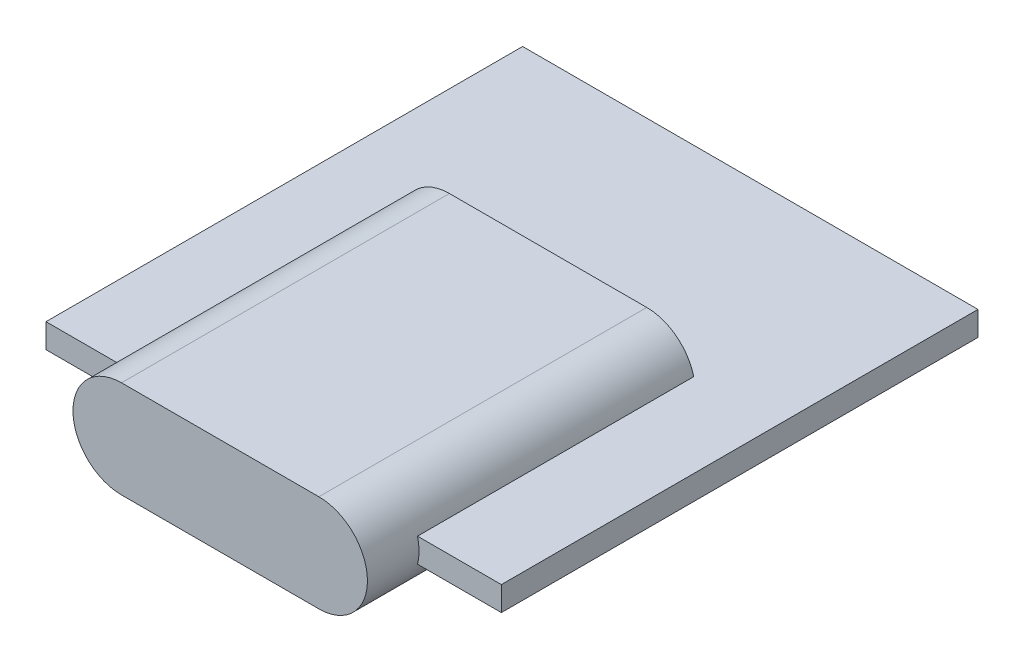
ISO-10303-21;
HEADER;
FILE_DESCRIPTION(('STEP AP214'),'2;1');
FILE_NAME('part.step','',(''),(''),'','','');
FILE_SCHEMA(('AUTOMOTIVE_DESIGN { 1 0 10303 214 1 1 1 1 }'));
ENDSEC;
DATA;
#1=APPLICATION_CONTEXT('core data for automotive mechanical design processes');
#2=APPLICATION_PROTOCOL_DEFINITION('international standard','automotive_design',2000,#1);
#3=PRODUCT_CONTEXT('',#1,'mechanical');
#4=PRODUCT('Part','Part','',(#3));
#5=PRODUCT_RELATED_PRODUCT_CATEGORY('part','',(#4));
#6=PRODUCT_DEFINITION_FORMATION('','',#4);
#7=PRODUCT_DEFINITION_CONTEXT('part definition',#1,'design');
#8=PRODUCT_DEFINITION('design','',#6,#7);
#9=PRODUCT_DEFINITION_SHAPE('','',#8);
#10=(LENGTH_UNIT() NAMED_UNIT(*) SI_UNIT(.MILLI.,.METRE.));
#11=(NAMED_UNIT(*) PLANE_ANGLE_UNIT() SI_UNIT($,.RADIAN.));
#12=(NAMED_UNIT(*) SI_UNIT($,.STERADIAN.) SOLID_ANGLE_UNIT());
#13=UNCERTAINTY_MEASURE_WITH_UNIT(LENGTH_MEASURE(1.E-05),#10,'distance_accuracy_value','');
#14=(GEOMETRIC_REPRESENTATION_CONTEXT(3) GLOBAL_UNCERTAINTY_ASSIGNED_CONTEXT((#13)) GLOBAL_UNIT_ASSIGNED_CONTEXT((#10,
#11,#12)) REPRESENTATION_CONTEXT('',''));
#15=CARTESIAN_POINT('',(0.,0.,0.));
#16=DIRECTION('',(0.,0.,1.));
#17=DIRECTION('',(1.,0.,0.));
#18=AXIS2_PLACEMENT_3D('',#15,#16,#17);
#19=CARTESIAN_POINT('',(-7.13270925110132,0.8,8.02290748898678));
#20=DIRECTION('',(0.,0.,-1.));
#21=DIRECTION('',(-1.,0.,0.));
#22=AXIS2_PLACEMENT_3D('',#19,#20,#21);
#23=PLANE('',#22);
#24=DIRECTION('',(1.,0.,0.));
#25=VECTOR('',#24,1.);
#26=CARTESIAN_POINT('',(-7.13270925110132,0.,8.02290748898678));
#27=LINE('',#26,#25);
#28=CARTESIAN_POINT('',(-7.13270925110132,0.,8.02290748898678));
#29=VERTEX_POINT('',#28);
#30=CARTESIAN_POINT('',(-4.49363219401144,0.,8.02290748898678));
#31=VERTEX_POINT('',#30);
#32=EDGE_CURVE('E193',#29,#31,#27,.T.);
#33=ORIENTED_EDGE('',*,*,#32,.T.);
#34=CARTESIAN_POINT('',(-2.94443885552847,0.4,8.02290748898678));
#35=DIRECTION('',(0.,0.,-1.));
#36=DIRECTION('',(-1.,0.,0.));
#37=AXIS2_PLACEMENT_3D('',#34,#35,#36);
#38=CIRCLE('',#37,1.6);
#39=CARTESIAN_POINT('',(-4.49363219401144,0.8,8.02290748898678));
#40=VERTEX_POINT('',#39);
#41=EDGE_CURVE('E174',#31,#40,#38,.T.);
#42=ORIENTED_EDGE('',*,*,#41,.T.);
#43=DIRECTION('',(1.,0.,0.));
#44=VECTOR('',#43,1.);
#45=CARTESIAN_POINT('',(-7.13270925110132,0.8,8.02290748898678));
#46=LINE('',#45,#44);
#47=CARTESIAN_POINT('',(-7.13270925110132,0.8,8.02290748898678));
#48=VERTEX_POINT('',#47);
#49=EDGE_CURVE('E183',#48,#40,#46,.T.);
#50=ORIENTED_EDGE('',*,*,#49,.F.);
#51=DIRECTION('',(0.,-1.,0.));
#52=VECTOR('',#51,1.);
#53=CARTESIAN_POINT('',(-7.13270925110132,0.8,8.02290748898678));
#54=LINE('',#53,#52);
#55=EDGE_CURVE('E207',#48,#29,#54,.T.);
#56=ORIENTED_EDGE('',*,*,#55,.T.);
#57=EDGE_LOOP('',(#33,#42,#50,#56));
#58=FACE_BOUND('',#57,.T.);
#59=ADVANCED_FACE('F35',(#58),#23,.F.);
#60=CARTESIAN_POINT('',(-7.13270925110132,0.8,-7.67709251101322));
#61=DIRECTION('',(1.,0.,0.));
#62=DIRECTION('',(0.,0.,-1.));
#63=AXIS2_PLACEMENT_3D('',#60,#61,#62);
#64=PLANE('',#63);
#65=DIRECTION('',(0.,0.,1.));
#66=VECTOR('',#65,1.);
#67=CARTESIAN_POINT('',(-7.13270925110132,0.,-7.67709251101322));
#68=LINE('',#67,#66);
#69=CARTESIAN_POINT('',(-7.13270925110132,0.,-7.67709251101322));
#70=VERTEX_POINT('',#69);
#71=EDGE_CURVE('E177',#70,#29,#68,.T.);
#72=ORIENTED_EDGE('',*,*,#71,.T.);
#73=ORIENTED_EDGE('',*,*,#55,.F.);
#74=DIRECTION('',(0.,0.,1.));
#75=VECTOR('',#74,1.);
#76=CARTESIAN_POINT('',(-7.13270925110132,0.8,-7.67709251101322));
#77=LINE('',#76,#75);
#78=CARTESIAN_POINT('',(-7.13270925110132,0.8,-7.67709251101322));
#79=VERTEX_POINT('',#78);
#80=EDGE_CURVE('E178',#79,#48,#77,.T.);
#81=ORIENTED_EDGE('',*,*,#80,.F.);
#82=DIRECTION('',(0.,-1.,0.));
#83=VECTOR('',#82,1.);
#84=CARTESIAN_POINT('',(-7.13270925110132,0.8,-7.67709251101322));
#85=LINE('',#84,#83);
#86=EDGE_CURVE('E189',#79,#70,#85,.T.);
#87=ORIENTED_EDGE('',*,*,#86,.T.);
#88=EDGE_LOOP('',(#72,#73,#81,#87));
#89=FACE_BOUND('',#88,.T.);
#90=ADVANCED_FACE('F37',(#89),#64,.F.);
#91=CARTESIAN_POINT('',(5.1047544829545,0.8,8.02290748898678));
#92=VERTEX_POINT('',#91);
#93=CARTESIAN_POINT('',(7.86729074889868,0.8,8.02290748898678));
#94=VERTEX_POINT('',#93);
#95=EDGE_CURVE('E181',#92,#94,#46,.T.);
#96=ORIENTED_EDGE('',*,*,#95,.F.);
#97=CARTESIAN_POINT('',(3.55556114447153,0.4,8.02290748898678));
#98=DIRECTION('',(0.,0.,-1.));
#99=DIRECTION('',(-1.,0.,0.));
#100=AXIS2_PLACEMENT_3D('',#97,#98,#99);
#101=CIRCLE('',#100,1.6);
#102=CARTESIAN_POINT('',(5.1047544829545,0.,8.02290748898678));
#103=VERTEX_POINT('',#102);
#104=EDGE_CURVE('E170',#92,#103,#101,.T.);
#105=ORIENTED_EDGE('',*,*,#104,.T.);
#106=CARTESIAN_POINT('',(7.86729074889868,0.,8.02290748898678));
#107=VERTEX_POINT('',#106);
#108=EDGE_CURVE('E192',#103,#107,#27,.T.);
#109=ORIENTED_EDGE('',*,*,#108,.T.);
#110=DIRECTION('',(0.,-1.,0.));
#111=VECTOR('',#110,1.);
#112=CARTESIAN_POINT('',(7.86729074889868,0.8,8.02290748898678));
#113=LINE('',#112,#111);
#114=EDGE_CURVE('E204',#94,#107,#113,.T.);
#115=ORIENTED_EDGE('',*,*,#114,.F.);
#116=EDGE_LOOP('',(#96,#105,#109,#115));
#117=FACE_BOUND('',#116,.T.);
#118=ADVANCED_FACE('F242',(#117),#23,.F.);
#119=CARTESIAN_POINT('',(7.86729074889868,0.8,-7.67709251101322));
#120=DIRECTION('',(-1.,0.,0.));
#121=DIRECTION('',(0.,0.,1.));
#122=AXIS2_PLACEMENT_3D('',#119,#120,#121);
#123=PLANE('',#122);
#124=DIRECTION('',(0.,0.,-1.));
#125=VECTOR('',#124,1.);
#126=CARTESIAN_POINT('',(7.86729074889868,0.,-7.67709251101322));
#127=LINE('',#126,#125);
#128=CARTESIAN_POINT('',(7.86729074889868,0.,-7.67709251101322));
#129=VERTEX_POINT('',#128);
#130=EDGE_CURVE('E196',#107,#129,#127,.T.);
#131=ORIENTED_EDGE('',*,*,#130,.T.);
#132=DIRECTION('',(0.,-1.,0.));
#133=VECTOR('',#132,1.);
#134=CARTESIAN_POINT('',(7.86729074889868,0.8,-7.67709251101322));
#135=LINE('',#134,#133);
#136=CARTESIAN_POINT('',(7.86729074889868,0.8,-7.67709251101322));
#137=VERTEX_POINT('',#136);
#138=EDGE_CURVE('E201',#137,#129,#135,.T.);
#139=ORIENTED_EDGE('',*,*,#138,.F.);
#140=DIRECTION('',(0.,0.,-1.));
#141=VECTOR('',#140,1.);
#142=CARTESIAN_POINT('',(7.86729074889868,0.8,-7.67709251101322));
#143=LINE('',#142,#141);
#144=EDGE_CURVE('E185',#94,#137,#143,.T.);
#145=ORIENTED_EDGE('',*,*,#144,.F.);
#146=ORIENTED_EDGE('',*,*,#114,.T.);
#147=EDGE_LOOP('',(#131,#139,#145,#146));
#148=FACE_BOUND('',#147,.T.);
#149=ADVANCED_FACE('F249',(#148),#123,.F.);
#150=CARTESIAN_POINT('',(-7.13270925110132,0.8,-7.67709251101322));
#151=DIRECTION('',(0.,0.,1.));
#152=DIRECTION('',(1.,0.,0.));
#153=AXIS2_PLACEMENT_3D('',#150,#151,#152);
#154=PLANE('',#153);
#155=DIRECTION('',(-1.,0.,0.));
#156=VECTOR('',#155,1.);
#157=CARTESIAN_POINT('',(-7.13270925110132,0.,-7.67709251101322));
#158=LINE('',#157,#156);
#159=EDGE_CURVE('E182',#129,#70,#158,.T.);
#160=ORIENTED_EDGE('',*,*,#159,.T.);
#161=ORIENTED_EDGE('',*,*,#86,.F.);
#162=DIRECTION('',(-1.,0.,0.));
#163=VECTOR('',#162,1.);
#164=CARTESIAN_POINT('',(-7.13270925110132,0.8,-7.67709251101322));
#165=LINE('',#164,#163);
#166=EDGE_CURVE('E187',#137,#79,#165,.T.);
#167=ORIENTED_EDGE('',*,*,#166,.F.);
#168=ORIENTED_EDGE('',*,*,#138,.T.);
#169=EDGE_LOOP('',(#160,#161,#167,#168));
#170=FACE_BOUND('',#169,.T.);
#171=ADVANCED_FACE('F254',(#170),#154,.F.);
#172=CARTESIAN_POINT('',(0.,0.8,0.));
#173=DIRECTION('',(0.,1.,0.));
#174=DIRECTION('',(0.,0.,1.));
#175=AXIS2_PLACEMENT_3D('',#172,#173,#174);
#176=PLANE('',#175);
#177=DIRECTION('',(0.,0.,1.));
#178=VECTOR('',#177,1.);
#179=CARTESIAN_POINT('',(-4.49363219401144,0.8,-1.07709251101322));
#180=LINE('',#179,#178);
#181=CARTESIAN_POINT('',(-4.49363219401144,0.8,-1.07709251101322));
#182=VERTEX_POINT('',#181);
#183=EDGE_CURVE('E55',#182,#40,#180,.T.);
#184=ORIENTED_EDGE('',*,*,#183,.F.);
#185=DIRECTION('',(1.,0.,0.));
#186=VECTOR('',#185,1.);
#187=CARTESIAN_POINT('',(0.,0.8,-1.07709251101322));
#188=LINE('',#187,#186);
#189=CARTESIAN_POINT('',(5.1047544829545,0.8,-1.07709251101322));
#190=VERTEX_POINT('',#189);
#191=EDGE_CURVE('E50',#182,#190,#188,.T.);
#192=ORIENTED_EDGE('',*,*,#191,.T.);
#193=DIRECTION('',(0.,0.,1.));
#194=VECTOR('',#193,1.);
#195=CARTESIAN_POINT('',(5.1047544829545,0.8,-1.07709251101322));
#196=LINE('',#195,#194);
#197=EDGE_CURVE('E172',#92,#190,#196,.F.);
#198=ORIENTED_EDGE('',*,*,#197,.F.);
#199=ORIENTED_EDGE('',*,*,#95,.T.);
#200=ORIENTED_EDGE('',*,*,#144,.T.);
#201=ORIENTED_EDGE('',*,*,#166,.T.);
#202=ORIENTED_EDGE('',*,*,#80,.T.);
#203=ORIENTED_EDGE('',*,*,#49,.T.);
#204=EDGE_LOOP('',(#184,#192,#198,#199,#200,#201,#202,#203));
#205=FACE_BOUND('',#204,.T.);
#206=ADVANCED_FACE('F259',(#205),#176,.T.);
#207=CARTESIAN_POINT('',(0.,0.,0.));
#208=DIRECTION('',(0.,1.,0.));
#209=DIRECTION('',(0.,0.,1.));
#210=AXIS2_PLACEMENT_3D('',#207,#208,#209);
#211=PLANE('',#210);
#212=DIRECTION('',(1.,0.,0.));
#213=VECTOR('',#212,1.);
#214=CARTESIAN_POINT('',(0.,0.,-1.07709251101322));
#215=LINE('',#214,#213);
#216=CARTESIAN_POINT('',(-4.49363219401144,0.,-1.07709251101322));
#217=VERTEX_POINT('',#216);
#218=CARTESIAN_POINT('',(5.1047544829545,0.,-1.07709251101322));
#219=VERTEX_POINT('',#218);
#220=EDGE_CURVE('E210',#217,#219,#215,.T.);
#221=ORIENTED_EDGE('',*,*,#220,.F.);
#222=DIRECTION('',(0.,0.,1.));
#223=VECTOR('',#222,1.);
#224=CARTESIAN_POINT('',(-4.49363219401144,0.,-1.07709251101322));
#225=LINE('',#224,#223);
#226=EDGE_CURVE('E11',#217,#31,#225,.T.);
#227=ORIENTED_EDGE('',*,*,#226,.T.);
#228=ORIENTED_EDGE('',*,*,#32,.F.);
#229=ORIENTED_EDGE('',*,*,#71,.F.);
#230=ORIENTED_EDGE('',*,*,#159,.F.);
#231=ORIENTED_EDGE('',*,*,#130,.F.);
#232=ORIENTED_EDGE('',*,*,#108,.F.);
#233=DIRECTION('',(0.,0.,1.));
#234=VECTOR('',#233,1.);
#235=CARTESIAN_POINT('',(5.1047544829545,0.,-1.07709251101322));
#236=LINE('',#235,#234);
#237=EDGE_CURVE('E43',#103,#219,#236,.F.);
#238=ORIENTED_EDGE('',*,*,#237,.T.);
#239=EDGE_LOOP('',(#221,#227,#228,#229,#230,#231,#232,#238));
#240=FACE_BOUND('',#239,.T.);
#241=ADVANCED_FACE('F214',(#240),#211,.F.);
#242=CARTESIAN_POINT('',(-2.94443885552847,0.4,-1.07709251101322));
#243=DIRECTION('',(0.,0.,1.));
#244=DIRECTION('',(1.,0.,0.));
#245=AXIS2_PLACEMENT_3D('',#242,#243,#244);
#246=PLANE('',#245);
#247=CARTESIAN_POINT('',(-2.94443885552847,0.4,-1.07709251101322));
#248=DIRECTION('',(0.,0.,1.));
#249=DIRECTION('',(1.,0.,0.));
#250=AXIS2_PLACEMENT_3D('',#247,#248,#249);
#251=CIRCLE('',#250,1.6);
#252=CARTESIAN_POINT('',(-2.94443885552847,-1.2,-1.07709251101322));
#253=VERTEX_POINT('',#252);
#254=EDGE_CURVE('E122',#217,#253,#251,.T.);
#255=ORIENTED_EDGE('',*,*,#254,.F.);
#256=ORIENTED_EDGE('',*,*,#220,.T.);
#257=CARTESIAN_POINT('',(3.55556114447153,0.4,-1.07709251101322));
#258=DIRECTION('',(0.,0.,1.));
#259=DIRECTION('',(1.,0.,0.));
#260=AXIS2_PLACEMENT_3D('',#257,#258,#259);
#261=CIRCLE('',#260,1.6);
#262=CARTESIAN_POINT('',(3.55556114447153,-1.2,-1.07709251101322));
#263=VERTEX_POINT('',#262);
#264=EDGE_CURVE('E149',#263,#219,#261,.T.);
#265=ORIENTED_EDGE('',*,*,#264,.F.);
#266=DIRECTION('',(1.,0.,0.));
#267=VECTOR('',#266,1.);
#268=CARTESIAN_POINT('',(-2.94443885552847,-1.2,-1.07709251101322));
#269=LINE('',#268,#267);
#270=EDGE_CURVE('E139',#253,#263,#269,.T.);
#271=ORIENTED_EDGE('',*,*,#270,.F.);
#272=EDGE_LOOP('',(#255,#256,#265,#271));
#273=FACE_BOUND('',#272,.T.);
#274=ADVANCED_FACE('F147',(#273),#246,.F.);
#275=CARTESIAN_POINT('',(-2.94443885552847,0.4,-1.07709251101322));
#276=DIRECTION('',(0.,0.,1.));
#277=DIRECTION('',(1.,0.,0.));
#278=AXIS2_PLACEMENT_3D('',#275,#276,#277);
#279=CYLINDRICAL_SURFACE('',#278,1.6);
#280=CARTESIAN_POINT('',(-2.94443885552847,2.,-1.07709251101322));
#281=VERTEX_POINT('',#280);
#282=EDGE_CURVE('E133',#281,#182,#251,.T.);
#283=ORIENTED_EDGE('',*,*,#282,.T.);
#284=ORIENTED_EDGE('',*,*,#183,.T.);
#285=ORIENTED_EDGE('',*,*,#41,.F.);
#286=ORIENTED_EDGE('',*,*,#226,.F.);
#287=ORIENTED_EDGE('',*,*,#254,.T.);
#288=DIRECTION('',(0.,0.,1.));
#289=VECTOR('',#288,1.);
#290=CARTESIAN_POINT('',(-2.94443885552847,-1.2,-1.07709251101322));
#291=LINE('',#290,#289);
#292=CARTESIAN_POINT('',(-2.94443885552847,-1.2,9.72290748898678));
#293=VERTEX_POINT('',#292);
#294=EDGE_CURVE('E127',#253,#293,#291,.T.);
#295=ORIENTED_EDGE('',*,*,#294,.T.);
#296=CARTESIAN_POINT('',(-2.94443885552847,0.4,9.72290748898678));
#297=DIRECTION('',(0.,0.,1.));
#298=DIRECTION('',(1.,0.,0.));
#299=AXIS2_PLACEMENT_3D('',#296,#297,#298);
#300=CIRCLE('',#299,1.6);
#301=CARTESIAN_POINT('',(-2.94443885552847,2.,9.72290748898678));
#302=VERTEX_POINT('',#301);
#303=EDGE_CURVE('E156',#302,#293,#300,.T.);
#304=ORIENTED_EDGE('',*,*,#303,.F.);
#305=DIRECTION('',(0.,0.,1.));
#306=VECTOR('',#305,1.);
#307=CARTESIAN_POINT('',(-2.94443885552847,2.,-1.07709251101322));
#308=LINE('',#307,#306);
#309=EDGE_CURVE('E164',#281,#302,#308,.T.);
#310=ORIENTED_EDGE('',*,*,#309,.F.);
#311=EDGE_LOOP('',(#283,#284,#285,#286,#287,#295,#304,#310));
#312=FACE_BOUND('',#311,.T.);
#313=ADVANCED_FACE('F125',(#312),#279,.T.);
#314=CARTESIAN_POINT('',(-2.94443885552847,2.,-1.07709251101322));
#315=DIRECTION('',(0.,1.,0.));
#316=DIRECTION('',(-1.,0.,0.));
#317=AXIS2_PLACEMENT_3D('',#314,#315,#316);
#318=PLANE('',#317);
#319=DIRECTION('',(-1.,0.,0.));
#320=VECTOR('',#319,1.);
#321=CARTESIAN_POINT('',(-2.94443885552847,2.,9.72290748898678));
#322=LINE('',#321,#320);
#323=CARTESIAN_POINT('',(3.55556114447153,2.,9.72290748898678));
#324=VERTEX_POINT('',#323);
#325=EDGE_CURVE('E134',#324,#302,#322,.T.);
#326=ORIENTED_EDGE('',*,*,#325,.F.);
#327=DIRECTION('',(0.,0.,1.));
#328=VECTOR('',#327,1.);
#329=CARTESIAN_POINT('',(3.55556114447153,2.,-1.07709251101322));
#330=LINE('',#329,#328);
#331=CARTESIAN_POINT('',(3.55556114447153,2.,-1.07709251101322));
#332=VERTEX_POINT('',#331);
#333=EDGE_CURVE('E166',#332,#324,#330,.T.);
#334=ORIENTED_EDGE('',*,*,#333,.F.);
#335=DIRECTION('',(-1.,0.,0.));
#336=VECTOR('',#335,1.);
#337=CARTESIAN_POINT('',(-2.94443885552847,2.,-1.07709251101322));
#338=LINE('',#337,#336);
#339=EDGE_CURVE('E144',#332,#281,#338,.T.);
#340=ORIENTED_EDGE('',*,*,#339,.T.);
#341=ORIENTED_EDGE('',*,*,#309,.T.);
#342=EDGE_LOOP('',(#326,#334,#340,#341));
#343=FACE_BOUND('',#342,.T.);
#344=ADVANCED_FACE('F230',(#343),#318,.T.);
#345=CARTESIAN_POINT('',(3.55556114447153,0.4,-1.07709251101322));
#346=DIRECTION('',(0.,0.,1.));
#347=DIRECTION('',(1.,0.,0.));
#348=AXIS2_PLACEMENT_3D('',#345,#346,#347);
#349=CYLINDRICAL_SURFACE('',#348,1.6);
#350=ORIENTED_EDGE('',*,*,#104,.F.);
#351=ORIENTED_EDGE('',*,*,#197,.T.);
#352=EDGE_CURVE('E150',#190,#332,#261,.T.);
#353=ORIENTED_EDGE('',*,*,#352,.T.);
#354=ORIENTED_EDGE('',*,*,#333,.T.);
#355=CARTESIAN_POINT('',(3.55556114447153,0.4,9.72290748898678));
#356=DIRECTION('',(0.,0.,1.));
#357=DIRECTION('',(1.,0.,0.));
#358=AXIS2_PLACEMENT_3D('',#355,#356,#357);
#359=CIRCLE('',#358,1.6);
#360=CARTESIAN_POINT('',(3.55556114447153,-1.2,9.72290748898678));
#361=VERTEX_POINT('',#360);
#362=EDGE_CURVE('E159',#361,#324,#359,.T.);
#363=ORIENTED_EDGE('',*,*,#362,.F.);
#364=DIRECTION('',(0.,0.,1.));
#365=VECTOR('',#364,1.);
#366=CARTESIAN_POINT('',(3.55556114447153,-1.2,-1.07709251101322));
#367=LINE('',#366,#365);
#368=EDGE_CURVE('E143',#263,#361,#367,.T.);
#369=ORIENTED_EDGE('',*,*,#368,.F.);
#370=ORIENTED_EDGE('',*,*,#264,.T.);
#371=ORIENTED_EDGE('',*,*,#237,.F.);
#372=EDGE_LOOP('',(#350,#351,#353,#354,#363,#369,#370,#371));
#373=FACE_BOUND('',#372,.T.);
#374=ADVANCED_FACE('F218',(#373),#349,.T.);
#375=CARTESIAN_POINT('',(-2.94443885552847,-1.2,-1.07709251101322));
#376=DIRECTION('',(0.,-1.,0.));
#377=DIRECTION('',(1.,0.,0.));
#378=AXIS2_PLACEMENT_3D('',#375,#376,#377);
#379=PLANE('',#378);
#380=DIRECTION('',(1.,0.,0.));
#381=VECTOR('',#380,1.);
#382=CARTESIAN_POINT('',(-2.94443885552847,-1.2,9.72290748898678));
#383=LINE('',#382,#381);
#384=EDGE_CURVE('E141',#293,#361,#383,.T.);
#385=ORIENTED_EDGE('',*,*,#384,.F.);
#386=ORIENTED_EDGE('',*,*,#294,.F.);
#387=ORIENTED_EDGE('',*,*,#270,.T.);
#388=ORIENTED_EDGE('',*,*,#368,.T.);
#389=EDGE_LOOP('',(#385,#386,#387,#388));
#390=FACE_BOUND('',#389,.T.);
#391=ADVANCED_FACE('F138',(#390),#379,.T.);
#392=ORIENTED_EDGE('',*,*,#191,.F.);
#393=ORIENTED_EDGE('',*,*,#282,.F.);
#394=ORIENTED_EDGE('',*,*,#339,.F.);
#395=ORIENTED_EDGE('',*,*,#352,.F.);
#396=EDGE_LOOP('',(#392,#393,#394,#395));
#397=FACE_BOUND('',#396,.T.);
#398=ADVANCED_FACE('F228',(#397),#246,.F.);
#399=CARTESIAN_POINT('',(-2.94443885552847,0.4,9.72290748898678));
#400=DIRECTION('',(0.,0.,1.));
#401=DIRECTION('',(1.,0.,0.));
#402=AXIS2_PLACEMENT_3D('',#399,#400,#401);
#403=PLANE('',#402);
#404=ORIENTED_EDGE('',*,*,#303,.T.);
#405=ORIENTED_EDGE('',*,*,#384,.T.);
#406=ORIENTED_EDGE('',*,*,#362,.T.);
#407=ORIENTED_EDGE('',*,*,#325,.T.);
#408=EDGE_LOOP('',(#404,#405,#406,#407));
#409=FACE_BOUND('',#408,.T.);
#410=ADVANCED_FACE('F223',(#409),#403,.T.);
#411=CLOSED_SHELL('',(#59,#90,#118,#149,#171,#206,#241,#274,#313,#344,#374,#391,#398,#410));
#412=MANIFOLD_SOLID_BREP('B2',#411);
#413=ADVANCED_BREP_SHAPE_REPRESENTATION('',(#18,#412),#14);
#414=SHAPE_DEFINITION_REPRESENTATION(#9,#413);
ENDSEC;
END-ISO-10303-21;
